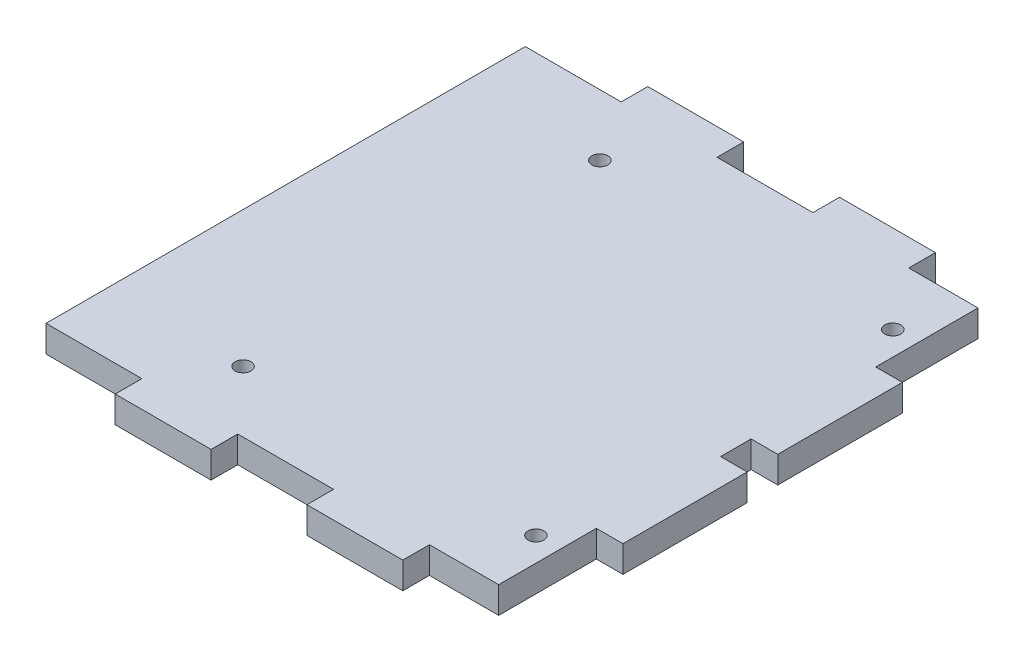
ISO-10303-21;
HEADER;
FILE_DESCRIPTION(('STEP AP214'),'2;1');
FILE_NAME('part.step','',(''),(''),'','','');
FILE_SCHEMA(('AUTOMOTIVE_DESIGN { 1 0 10303 214 1 1 1 1 }'));
ENDSEC;
DATA;
#1=APPLICATION_CONTEXT('core data for automotive mechanical design processes');
#2=APPLICATION_PROTOCOL_DEFINITION('international standard','automotive_design',2000,#1);
#3=PRODUCT_CONTEXT('',#1,'mechanical');
#4=PRODUCT('Part','Part','',(#3));
#5=PRODUCT_RELATED_PRODUCT_CATEGORY('part','',(#4));
#6=PRODUCT_DEFINITION_FORMATION('','',#4);
#7=PRODUCT_DEFINITION_CONTEXT('part definition',#1,'design');
#8=PRODUCT_DEFINITION('design','',#6,#7);
#9=PRODUCT_DEFINITION_SHAPE('','',#8);
#10=(LENGTH_UNIT() NAMED_UNIT(*) SI_UNIT(.MILLI.,.METRE.));
#11=(NAMED_UNIT(*) PLANE_ANGLE_UNIT() SI_UNIT($,.RADIAN.));
#12=(NAMED_UNIT(*) SI_UNIT($,.STERADIAN.) SOLID_ANGLE_UNIT());
#13=UNCERTAINTY_MEASURE_WITH_UNIT(LENGTH_MEASURE(1.E-05),#10,'distance_accuracy_value','');
#14=(GEOMETRIC_REPRESENTATION_CONTEXT(3) GLOBAL_UNCERTAINTY_ASSIGNED_CONTEXT((#13)) GLOBAL_UNIT_ASSIGNED_CONTEXT((#10,
#11,#12)) REPRESENTATION_CONTEXT('',''));
#15=CARTESIAN_POINT('',(0.,0.,0.));
#16=DIRECTION('',(0.,0.,1.));
#17=DIRECTION('',(1.,0.,0.));
#18=AXIS2_PLACEMENT_3D('',#15,#16,#17);
#19=CARTESIAN_POINT('',(57.15,6.35,63.5));
#20=DIRECTION('',(-1.,0.,0.));
#21=DIRECTION('',(0.,0.,1.));
#22=AXIS2_PLACEMENT_3D('',#19,#20,#21);
#23=PLANE('',#22);
#24=DIRECTION('',(0.,-1.,0.));
#25=VECTOR('',#24,1.);
#26=CARTESIAN_POINT('',(57.1500000000002,0.,33.8666666666667));
#27=LINE('',#26,#25);
#28=CARTESIAN_POINT('',(57.1500000000002,6.34999999999998,33.8666666666667));
#29=VERTEX_POINT('',#28);
#30=CARTESIAN_POINT('',(57.1500000000002,0.,33.8666666666667));
#31=VERTEX_POINT('',#30);
#32=EDGE_CURVE('E373',#29,#31,#27,.T.);
#33=ORIENTED_EDGE('',*,*,#32,.T.);
#34=DIRECTION('',(0.,0.,-1.));
#35=VECTOR('',#34,1.);
#36=CARTESIAN_POINT('',(57.15,0.,63.5));
#37=LINE('',#36,#35);
#38=CARTESIAN_POINT('',(57.1500000000002,0.,4.2333333333334));
#39=VERTEX_POINT('',#38);
#40=EDGE_CURVE('E276',#31,#39,#37,.T.);
#41=ORIENTED_EDGE('',*,*,#40,.T.);
#42=DIRECTION('',(0.,1.,0.));
#43=VECTOR('',#42,1.);
#44=CARTESIAN_POINT('',(57.1500000000002,0.,4.2333333333334));
#45=LINE('',#44,#43);
#46=CARTESIAN_POINT('',(57.1500000000002,6.34999999999998,4.2333333333334));
#47=VERTEX_POINT('',#46);
#48=EDGE_CURVE('E369',#39,#47,#45,.T.);
#49=ORIENTED_EDGE('',*,*,#48,.T.);
#50=DIRECTION('',(0.,0.,-1.));
#51=VECTOR('',#50,1.);
#52=CARTESIAN_POINT('',(57.15,6.35,63.5));
#53=LINE('',#52,#51);
#54=EDGE_CURVE('E258',#29,#47,#53,.T.);
#55=ORIENTED_EDGE('',*,*,#54,.F.);
#56=EDGE_LOOP('',(#33,#41,#49,#55));
#57=FACE_BOUND('',#56,.T.);
#58=ADVANCED_FACE('F45',(#57),#23,.F.);
#59=CARTESIAN_POINT('',(-57.15,6.35,-63.5));
#60=DIRECTION('',(0.,0.,1.));
#61=DIRECTION('',(1.,0.,0.));
#62=AXIS2_PLACEMENT_3D('',#59,#60,#61);
#63=PLANE('',#62);
#64=DIRECTION('',(0.,-1.,0.));
#65=VECTOR('',#64,1.);
#66=CARTESIAN_POINT('',(-34.29,0.,-63.4999999999997));
#67=LINE('',#66,#65);
#68=CARTESIAN_POINT('',(-34.29,6.35000000000005,-63.4999999999997));
#69=VERTEX_POINT('',#68);
#70=CARTESIAN_POINT('',(-34.29,0.,-63.5));
#71=VERTEX_POINT('',#70);
#72=EDGE_CURVE('E324',#69,#71,#67,.T.);
#73=ORIENTED_EDGE('',*,*,#72,.F.);
#74=DIRECTION('',(-1.,0.,0.));
#75=VECTOR('',#74,1.);
#76=CARTESIAN_POINT('',(-57.15,6.35,-63.5));
#77=LINE('',#76,#75);
#78=CARTESIAN_POINT('',(-11.43,6.35000000000006,-63.4999999999997));
#79=VERTEX_POINT('',#78);
#80=EDGE_CURVE('E286',#79,#69,#77,.T.);
#81=ORIENTED_EDGE('',*,*,#80,.F.);
#82=DIRECTION('',(0.,1.,0.));
#83=VECTOR('',#82,1.);
#84=CARTESIAN_POINT('',(-11.43,0.,-63.4999999999997));
#85=LINE('',#84,#83);
#86=CARTESIAN_POINT('',(-11.43,0.,-63.4999999999997));
#87=VERTEX_POINT('',#86);
#88=EDGE_CURVE('E314',#87,#79,#85,.T.);
#89=ORIENTED_EDGE('',*,*,#88,.F.);
#90=DIRECTION('',(-1.,0.,0.));
#91=VECTOR('',#90,1.);
#92=CARTESIAN_POINT('',(-57.15,0.,-63.5));
#93=LINE('',#92,#91);
#94=EDGE_CURVE('E272',#87,#71,#93,.T.);
#95=ORIENTED_EDGE('',*,*,#94,.T.);
#96=EDGE_LOOP('',(#73,#81,#89,#95));
#97=FACE_BOUND('',#96,.T.);
#98=ADVANCED_FACE('F487',(#97),#63,.F.);
#99=DIRECTION('',(0.,-1.,0.));
#100=VECTOR('',#99,1.);
#101=CARTESIAN_POINT('',(11.43,0.,-63.4999999999997));
#102=LINE('',#101,#100);
#103=CARTESIAN_POINT('',(11.43,6.35000000000005,-63.4999999999997));
#104=VERTEX_POINT('',#103);
#105=CARTESIAN_POINT('',(11.43,0.,-63.5));
#106=VERTEX_POINT('',#105);
#107=EDGE_CURVE('E344',#104,#106,#102,.T.);
#108=ORIENTED_EDGE('',*,*,#107,.F.);
#109=CARTESIAN_POINT('',(34.29,6.35000000000005,-63.4999999999997));
#110=VERTEX_POINT('',#109);
#111=EDGE_CURVE('E285',#110,#104,#77,.T.);
#112=ORIENTED_EDGE('',*,*,#111,.F.);
#113=DIRECTION('',(0.,1.,0.));
#114=VECTOR('',#113,1.);
#115=CARTESIAN_POINT('',(34.29,0.,-63.4999999999997));
#116=LINE('',#115,#114);
#117=CARTESIAN_POINT('',(34.29,0.,-63.4999999999997));
#118=VERTEX_POINT('',#117);
#119=EDGE_CURVE('E334',#118,#110,#116,.T.);
#120=ORIENTED_EDGE('',*,*,#119,.F.);
#121=EDGE_CURVE('E267',#118,#106,#93,.T.);
#122=ORIENTED_EDGE('',*,*,#121,.T.);
#123=EDGE_LOOP('',(#108,#112,#120,#122));
#124=FACE_BOUND('',#123,.T.);
#125=ADVANCED_FACE('F492',(#124),#63,.F.);
#126=CARTESIAN_POINT('',(-57.15,6.35,63.5));
#127=DIRECTION('',(1.,0.,0.));
#128=DIRECTION('',(0.,0.,-1.));
#129=AXIS2_PLACEMENT_3D('',#126,#127,#128);
#130=PLANE('',#129);
#131=DIRECTION('',(0.,-1.,0.));
#132=VECTOR('',#131,1.);
#133=CARTESIAN_POINT('',(-57.15,0.,-57.1499999999997));
#134=LINE('',#133,#132);
#135=CARTESIAN_POINT('',(-57.15,6.35,-57.1499999999997));
#136=VERTEX_POINT('',#135);
#137=CARTESIAN_POINT('',(-57.15,0.,-57.1499999999997));
#138=VERTEX_POINT('',#137);
#139=EDGE_CURVE('E305',#136,#138,#134,.T.);
#140=ORIENTED_EDGE('',*,*,#139,.T.);
#141=DIRECTION('',(0.,0.,1.));
#142=VECTOR('',#141,1.);
#143=CARTESIAN_POINT('',(-57.15,0.,63.5));
#144=LINE('',#143,#142);
#145=CARTESIAN_POINT('',(-57.15,0.,57.1500000000002));
#146=VERTEX_POINT('',#145);
#147=EDGE_CURVE('E261',#138,#146,#144,.T.);
#148=ORIENTED_EDGE('',*,*,#147,.T.);
#149=DIRECTION('',(0.,1.,0.));
#150=VECTOR('',#149,1.);
#151=CARTESIAN_POINT('',(-57.15,0.,57.1500000000002));
#152=LINE('',#151,#150);
#153=CARTESIAN_POINT('',(-57.15,6.35,57.1500000000002));
#154=VERTEX_POINT('',#153);
#155=EDGE_CURVE('E400',#146,#154,#152,.T.);
#156=ORIENTED_EDGE('',*,*,#155,.T.);
#157=DIRECTION('',(0.,0.,1.));
#158=VECTOR('',#157,1.);
#159=CARTESIAN_POINT('',(-57.15,6.35,63.5));
#160=LINE('',#159,#158);
#161=EDGE_CURVE('E282',#136,#154,#160,.T.);
#162=ORIENTED_EDGE('',*,*,#161,.F.);
#163=EDGE_LOOP('',(#140,#148,#156,#162));
#164=FACE_BOUND('',#163,.T.);
#165=ADVANCED_FACE('F559',(#164),#130,.F.);
#166=CARTESIAN_POINT('',(-57.15,6.35,63.5));
#167=DIRECTION('',(0.,0.,-1.));
#168=DIRECTION('',(-1.,0.,0.));
#169=AXIS2_PLACEMENT_3D('',#166,#167,#168);
#170=PLANE('',#169);
#171=DIRECTION('',(0.,-1.,0.));
#172=VECTOR('',#171,1.);
#173=CARTESIAN_POINT('',(34.29,0.,63.5000000000002));
#174=LINE('',#173,#172);
#175=CARTESIAN_POINT('',(34.29,6.35000000000005,63.5000000000002));
#176=VERTEX_POINT('',#175);
#177=CARTESIAN_POINT('',(34.29,0.,63.5));
#178=VERTEX_POINT('',#177);
#179=EDGE_CURVE('E417',#176,#178,#174,.T.);
#180=ORIENTED_EDGE('',*,*,#179,.F.);
#181=DIRECTION('',(1.,0.,0.));
#182=VECTOR('',#181,1.);
#183=CARTESIAN_POINT('',(-57.15,6.35,63.5));
#184=LINE('',#183,#182);
#185=CARTESIAN_POINT('',(11.43,6.35000000000006,63.5000000000002));
#186=VERTEX_POINT('',#185);
#187=EDGE_CURVE('E54',#186,#176,#184,.T.);
#188=ORIENTED_EDGE('',*,*,#187,.F.);
#189=DIRECTION('',(0.,1.,0.));
#190=VECTOR('',#189,1.);
#191=CARTESIAN_POINT('',(11.43,0.,63.5000000000002));
#192=LINE('',#191,#190);
#193=CARTESIAN_POINT('',(11.43,0.,63.5000000000002));
#194=VERTEX_POINT('',#193);
#195=EDGE_CURVE('E407',#194,#186,#192,.T.);
#196=ORIENTED_EDGE('',*,*,#195,.F.);
#197=DIRECTION('',(1.,0.,0.));
#198=VECTOR('',#197,1.);
#199=CARTESIAN_POINT('',(-57.15,0.,63.5));
#200=LINE('',#199,#198);
#201=EDGE_CURVE('E49',#194,#178,#200,.T.);
#202=ORIENTED_EDGE('',*,*,#201,.T.);
#203=EDGE_LOOP('',(#180,#188,#196,#202));
#204=FACE_BOUND('',#203,.T.);
#205=ADVANCED_FACE('F548',(#204),#170,.F.);
#206=DIRECTION('',(0.,-1.,0.));
#207=VECTOR('',#206,1.);
#208=CARTESIAN_POINT('',(-11.43,0.,63.5000000000002));
#209=LINE('',#208,#207);
#210=CARTESIAN_POINT('',(-11.43,6.35000000000005,63.5000000000002));
#211=VERTEX_POINT('',#210);
#212=CARTESIAN_POINT('',(-11.43,0.,63.5));
#213=VERTEX_POINT('',#212);
#214=EDGE_CURVE('E249',#211,#213,#209,.T.);
#215=ORIENTED_EDGE('',*,*,#214,.F.);
#216=CARTESIAN_POINT('',(-34.29,6.35000000000005,63.5000000000002));
#217=VERTEX_POINT('',#216);
#218=EDGE_CURVE('E13',#217,#211,#184,.T.);
#219=ORIENTED_EDGE('',*,*,#218,.F.);
#220=DIRECTION('',(0.,1.,0.));
#221=VECTOR('',#220,1.);
#222=CARTESIAN_POINT('',(-34.29,0.,63.5000000000002));
#223=LINE('',#222,#221);
#224=CARTESIAN_POINT('',(-34.29,0.,63.5000000000002));
#225=VERTEX_POINT('',#224);
#226=EDGE_CURVE('E235',#225,#217,#223,.T.);
#227=ORIENTED_EDGE('',*,*,#226,.F.);
#228=EDGE_CURVE('E248',#225,#213,#200,.T.);
#229=ORIENTED_EDGE('',*,*,#228,.T.);
#230=EDGE_LOOP('',(#215,#219,#227,#229));
#231=FACE_BOUND('',#230,.T.);
#232=ADVANCED_FACE('F247',(#231),#170,.F.);
#233=CARTESIAN_POINT('',(57.15,6.35,-63.5));
#234=DIRECTION('',(0.,-1.,0.));
#235=DIRECTION('',(0.,0.,-1.));
#236=AXIS2_PLACEMENT_3D('',#233,#234,#235);
#237=PLANE('',#236);
#238=CARTESIAN_POINT('',(-24.765,6.35000000000006,-42.5449999999997));
#239=DIRECTION('',(0.,-1.,0.));
#240=DIRECTION('',(0.,0.,-1.));
#241=AXIS2_PLACEMENT_3D('',#238,#239,#240);
#242=CIRCLE('',#241,1.90499999999986);
#243=CARTESIAN_POINT('',(-24.765,6.35000000000006,-44.4499999999996));
#244=VERTEX_POINT('',#243);
#245=EDGE_CURVE('E450',#244,#244,#242,.T.);
#246=ORIENTED_EDGE('',*,*,#245,.T.);
#247=EDGE_LOOP('',(#246));
#248=FACE_BOUND('',#247,.T.);
#249=CARTESIAN_POINT('',(-24.7650000000001,6.35000000000006,42.5450000000001));
#250=DIRECTION('',(0.,-1.,0.));
#251=DIRECTION('',(0.,0.,-1.));
#252=AXIS2_PLACEMENT_3D('',#249,#250,#251);
#253=CIRCLE('',#252,1.90499999999995);
#254=CARTESIAN_POINT('',(-24.7650000000001,6.35000000000006,40.6400000000001));
#255=VERTEX_POINT('',#254);
#256=EDGE_CURVE('E444',#255,#255,#253,.T.);
#257=ORIENTED_EDGE('',*,*,#256,.T.);
#258=EDGE_LOOP('',(#257));
#259=FACE_BOUND('',#258,.T.);
#260=CARTESIAN_POINT('',(45.0850000000001,6.35000000000006,42.5450000000001));
#261=DIRECTION('',(0.,-1.,0.));
#262=DIRECTION('',(0.,0.,-1.));
#263=AXIS2_PLACEMENT_3D('',#260,#261,#262);
#264=CIRCLE('',#263,1.90499999999995);
#265=CARTESIAN_POINT('',(45.0850000000001,6.35000000000006,40.6400000000001));
#266=VERTEX_POINT('',#265);
#267=EDGE_CURVE('E438',#266,#266,#264,.T.);
#268=ORIENTED_EDGE('',*,*,#267,.T.);
#269=EDGE_LOOP('',(#268));
#270=FACE_BOUND('',#269,.T.);
#271=CARTESIAN_POINT('',(45.0850000000001,6.35000000000006,-42.5449999999997));
#272=DIRECTION('',(0.,-1.,0.));
#273=DIRECTION('',(0.,0.,-1.));
#274=AXIS2_PLACEMENT_3D('',#271,#272,#273);
#275=CIRCLE('',#274,1.90499999999987);
#276=CARTESIAN_POINT('',(45.0850000000001,6.35000000000006,-44.4499999999996));
#277=VERTEX_POINT('',#276);
#278=EDGE_CURVE('E429',#277,#277,#275,.T.);
#279=ORIENTED_EDGE('',*,*,#278,.T.);
#280=EDGE_LOOP('',(#279));
#281=FACE_BOUND('',#280,.T.);
#282=DIRECTION('',(0.,0.,-1.));
#283=VECTOR('',#282,1.);
#284=CARTESIAN_POINT('',(-11.43,6.35000000000005,63.5000000000002));
#285=LINE('',#284,#283);
#286=CARTESIAN_POINT('',(-11.43,6.35000000000005,57.1500000000002));
#287=VERTEX_POINT('',#286);
#288=EDGE_CURVE('E420',#211,#287,#285,.T.);
#289=ORIENTED_EDGE('',*,*,#288,.T.);
#290=DIRECTION('',(-1.,0.,0.));
#291=VECTOR('',#290,1.);
#292=CARTESIAN_POINT('',(57.15,6.35,57.1500000000003));
#293=LINE('',#292,#291);
#294=CARTESIAN_POINT('',(11.43,6.35000000000005,57.1500000000002));
#295=VERTEX_POINT('',#294);
#296=EDGE_CURVE('E299',#295,#287,#293,.T.);
#297=ORIENTED_EDGE('',*,*,#296,.F.);
#298=DIRECTION('',(0.,0.,-1.));
#299=VECTOR('',#298,1.);
#300=CARTESIAN_POINT('',(11.43,6.35000000000005,63.5000000000002));
#301=LINE('',#300,#299);
#302=EDGE_CURVE('E410',#186,#295,#301,.T.);
#303=ORIENTED_EDGE('',*,*,#302,.F.);
#304=ORIENTED_EDGE('',*,*,#187,.T.);
#305=DIRECTION('',(0.,0.,-1.));
#306=VECTOR('',#305,1.);
#307=CARTESIAN_POINT('',(34.29,6.35000000000005,63.5000000000002));
#308=LINE('',#307,#306);
#309=CARTESIAN_POINT('',(34.29,6.35000000000005,57.1500000000002));
#310=VERTEX_POINT('',#309);
#311=EDGE_CURVE('E402',#176,#310,#308,.T.);
#312=ORIENTED_EDGE('',*,*,#311,.T.);
#313=CARTESIAN_POINT('',(50.8000000000002,6.34999999999999,57.15));
#314=VERTEX_POINT('',#313);
#315=EDGE_CURVE('E296',#314,#310,#293,.T.);
#316=ORIENTED_EDGE('',*,*,#315,.F.);
#317=DIRECTION('',(0.,0.,1.));
#318=VECTOR('',#317,1.);
#319=CARTESIAN_POINT('',(50.8000000000002,6.35,-63.5));
#320=LINE('',#319,#318);
#321=CARTESIAN_POINT('',(50.8000000000002,6.34999999999998,33.8666666666667));
#322=VERTEX_POINT('',#321);
#323=EDGE_CURVE('E293',#322,#314,#320,.T.);
#324=ORIENTED_EDGE('',*,*,#323,.F.);
#325=DIRECTION('',(1.,0.,0.));
#326=VECTOR('',#325,1.);
#327=CARTESIAN_POINT('',(50.8000000000002,6.34999999999998,33.8666666666667));
#328=LINE('',#327,#326);
#329=EDGE_CURVE('E366',#322,#29,#328,.T.);
#330=ORIENTED_EDGE('',*,*,#329,.T.);
#331=ORIENTED_EDGE('',*,*,#54,.T.);
#332=DIRECTION('',(1.,0.,0.));
#333=VECTOR('',#332,1.);
#334=CARTESIAN_POINT('',(50.8000000000002,6.34999999999998,4.2333333333334));
#335=LINE('',#334,#333);
#336=CARTESIAN_POINT('',(50.8000000000002,6.34999999999998,4.2333333333334));
#337=VERTEX_POINT('',#336);
#338=EDGE_CURVE('E364',#337,#47,#335,.T.);
#339=ORIENTED_EDGE('',*,*,#338,.F.);
#340=CARTESIAN_POINT('',(50.8000000000002,6.34999999999999,-3.04800000000004));
#341=VERTEX_POINT('',#340);
#342=EDGE_CURVE('E295',#341,#337,#320,.T.);
#343=ORIENTED_EDGE('',*,*,#342,.F.);
#344=DIRECTION('',(-1.,0.,0.));
#345=VECTOR('',#344,1.);
#346=CARTESIAN_POINT('',(310.160847408269,6.34999999999999,-3.04800000000006));
#347=LINE('',#346,#345);
#348=CARTESIAN_POINT('',(57.1500000000002,6.34999999999999,-3.04800000000004));
#349=VERTEX_POINT('',#348);
#350=EDGE_CURVE('E391',#349,#341,#347,.T.);
#351=ORIENTED_EDGE('',*,*,#350,.F.);
#352=CARTESIAN_POINT('',(57.1500000000002,6.35000000000001,-32.7660000000001));
#353=VERTEX_POINT('',#352);
#354=EDGE_CURVE('E256',#349,#353,#53,.T.);
#355=ORIENTED_EDGE('',*,*,#354,.T.);
#356=DIRECTION('',(-1.,0.,0.));
#357=VECTOR('',#356,1.);
#358=CARTESIAN_POINT('',(310.160847408269,6.34999999999999,-32.7660000000001));
#359=LINE('',#358,#357);
#360=CARTESIAN_POINT('',(50.8000000000002,6.35000000000001,-32.766));
#361=VERTEX_POINT('',#360);
#362=EDGE_CURVE('E387',#353,#361,#359,.T.);
#363=ORIENTED_EDGE('',*,*,#362,.T.);
#364=CARTESIAN_POINT('',(50.8,6.35,-57.1499999999997));
#365=VERTEX_POINT('',#364);
#366=EDGE_CURVE('E292',#365,#361,#320,.T.);
#367=ORIENTED_EDGE('',*,*,#366,.F.);
#368=DIRECTION('',(1.,0.,0.));
#369=VECTOR('',#368,1.);
#370=CARTESIAN_POINT('',(57.15,6.35,-57.1499999999997));
#371=LINE('',#370,#369);
#372=CARTESIAN_POINT('',(34.29,6.35000000000005,-57.1499999999997));
#373=VERTEX_POINT('',#372);
#374=EDGE_CURVE('E289',#373,#365,#371,.T.);
#375=ORIENTED_EDGE('',*,*,#374,.F.);
#376=DIRECTION('',(0.,0.,1.));
#377=VECTOR('',#376,1.);
#378=CARTESIAN_POINT('',(34.29,6.35000000000005,-63.4999999999997));
#379=LINE('',#378,#377);
#380=EDGE_CURVE('E337',#110,#373,#379,.T.);
#381=ORIENTED_EDGE('',*,*,#380,.F.);
#382=ORIENTED_EDGE('',*,*,#111,.T.);
#383=DIRECTION('',(0.,0.,1.));
#384=VECTOR('',#383,1.);
#385=CARTESIAN_POINT('',(11.43,6.35000000000005,-63.4999999999997));
#386=LINE('',#385,#384);
#387=CARTESIAN_POINT('',(11.43,6.35000000000005,-57.1499999999997));
#388=VERTEX_POINT('',#387);
#389=EDGE_CURVE('E327',#104,#388,#386,.T.);
#390=ORIENTED_EDGE('',*,*,#389,.T.);
#391=CARTESIAN_POINT('',(-11.43,6.35000000000005,-57.1499999999997));
#392=VERTEX_POINT('',#391);
#393=EDGE_CURVE('E291',#392,#388,#371,.T.);
#394=ORIENTED_EDGE('',*,*,#393,.F.);
#395=DIRECTION('',(0.,0.,1.));
#396=VECTOR('',#395,1.);
#397=CARTESIAN_POINT('',(-11.43,6.35000000000005,-63.4999999999997));
#398=LINE('',#397,#396);
#399=EDGE_CURVE('E317',#79,#392,#398,.T.);
#400=ORIENTED_EDGE('',*,*,#399,.F.);
#401=ORIENTED_EDGE('',*,*,#80,.T.);
#402=DIRECTION('',(0.,0.,1.));
#403=VECTOR('',#402,1.);
#404=CARTESIAN_POINT('',(-34.29,6.35000000000005,-63.4999999999997));
#405=LINE('',#404,#403);
#406=CARTESIAN_POINT('',(-34.29,6.35000000000005,-57.1499999999997));
#407=VERTEX_POINT('',#406);
#408=EDGE_CURVE('E309',#69,#407,#405,.T.);
#409=ORIENTED_EDGE('',*,*,#408,.T.);
#410=EDGE_CURVE('E279',#136,#407,#371,.T.);
#411=ORIENTED_EDGE('',*,*,#410,.F.);
#412=ORIENTED_EDGE('',*,*,#161,.T.);
#413=CARTESIAN_POINT('',(-34.29,6.35000000000005,57.1500000000002));
#414=VERTEX_POINT('',#413);
#415=EDGE_CURVE('E297',#414,#154,#293,.T.);
#416=ORIENTED_EDGE('',*,*,#415,.F.);
#417=DIRECTION('',(0.,0.,-1.));
#418=VECTOR('',#417,1.);
#419=CARTESIAN_POINT('',(-34.29,6.35000000000005,63.5000000000002));
#420=LINE('',#419,#418);
#421=EDGE_CURVE('E240',#217,#414,#420,.T.);
#422=ORIENTED_EDGE('',*,*,#421,.F.);
#423=ORIENTED_EDGE('',*,*,#218,.T.);
#424=EDGE_LOOP('',(#289,#297,#303,#304,#312,#316,#324,#330,#331,#339,#343,#351,#355,#363,#367,
#375,#381,#382,#390,#394,#400,#401,#409,#411,#412,#416,#422,#423));
#425=FACE_BOUND('',#424,.T.);
#426=ADVANCED_FACE('F460',(#248,#259,#270,#281,#425),#237,.F.);
#427=CARTESIAN_POINT('',(57.15,0.,-63.5));
#428=DIRECTION('',(0.,-1.,0.));
#429=DIRECTION('',(0.,0.,-1.));
#430=AXIS2_PLACEMENT_3D('',#427,#428,#429);
#431=PLANE('',#430);
#432=CARTESIAN_POINT('',(-24.765,0.,-42.5449999999997));
#433=DIRECTION('',(0.,-1.,0.));
#434=DIRECTION('',(0.,0.,-1.));
#435=AXIS2_PLACEMENT_3D('',#432,#433,#434);
#436=CIRCLE('',#435,1.90499999999986);
#437=CARTESIAN_POINT('',(-24.765,0.,-44.4499999999996));
#438=VERTEX_POINT('',#437);
#439=EDGE_CURVE('E447',#438,#438,#436,.T.);
#440=ORIENTED_EDGE('',*,*,#439,.F.);
#441=EDGE_LOOP('',(#440));
#442=FACE_BOUND('',#441,.T.);
#443=CARTESIAN_POINT('',(-24.7650000000001,0.,42.5450000000001));
#444=DIRECTION('',(0.,-1.,0.));
#445=DIRECTION('',(0.,0.,-1.));
#446=AXIS2_PLACEMENT_3D('',#443,#444,#445);
#447=CIRCLE('',#446,1.90499999999995);
#448=CARTESIAN_POINT('',(-24.7650000000001,0.,40.6400000000001));
#449=VERTEX_POINT('',#448);
#450=EDGE_CURVE('E441',#449,#449,#447,.T.);
#451=ORIENTED_EDGE('',*,*,#450,.F.);
#452=EDGE_LOOP('',(#451));
#453=FACE_BOUND('',#452,.T.);
#454=CARTESIAN_POINT('',(45.0850000000001,0.,42.5450000000001));
#455=DIRECTION('',(0.,-1.,0.));
#456=DIRECTION('',(0.,0.,-1.));
#457=AXIS2_PLACEMENT_3D('',#454,#455,#456);
#458=CIRCLE('',#457,1.90499999999995);
#459=CARTESIAN_POINT('',(45.0850000000001,0.,40.6400000000001));
#460=VERTEX_POINT('',#459);
#461=EDGE_CURVE('E435',#460,#460,#458,.T.);
#462=ORIENTED_EDGE('',*,*,#461,.F.);
#463=EDGE_LOOP('',(#462));
#464=FACE_BOUND('',#463,.T.);
#465=CARTESIAN_POINT('',(45.0850000000001,0.,-42.5449999999997));
#466=DIRECTION('',(0.,-1.,0.));
#467=DIRECTION('',(0.,0.,-1.));
#468=AXIS2_PLACEMENT_3D('',#465,#466,#467);
#469=CIRCLE('',#468,1.90499999999987);
#470=CARTESIAN_POINT('',(45.0850000000001,0.,-44.4499999999996));
#471=VERTEX_POINT('',#470);
#472=EDGE_CURVE('E432',#471,#471,#469,.T.);
#473=ORIENTED_EDGE('',*,*,#472,.F.);
#474=EDGE_LOOP('',(#473));
#475=FACE_BOUND('',#474,.T.);
#476=ORIENTED_EDGE('',*,*,#147,.F.);
#477=DIRECTION('',(1.,0.,0.));
#478=VECTOR('',#477,1.);
#479=CARTESIAN_POINT('',(-57.15,0.,-57.1499999999997));
#480=LINE('',#479,#478);
#481=CARTESIAN_POINT('',(-34.29,0.,-57.1499999999997));
#482=VERTEX_POINT('',#481);
#483=EDGE_CURVE('E300',#138,#482,#480,.T.);
#484=ORIENTED_EDGE('',*,*,#483,.T.);
#485=DIRECTION('',(0.,0.,1.));
#486=VECTOR('',#485,1.);
#487=CARTESIAN_POINT('',(-34.29,0.,-63.4999999999997));
#488=LINE('',#487,#486);
#489=EDGE_CURVE('E310',#71,#482,#488,.T.);
#490=ORIENTED_EDGE('',*,*,#489,.F.);
#491=ORIENTED_EDGE('',*,*,#94,.F.);
#492=DIRECTION('',(0.,0.,1.));
#493=VECTOR('',#492,1.);
#494=CARTESIAN_POINT('',(-11.43,0.,-63.4999999999997));
#495=LINE('',#494,#493);
#496=CARTESIAN_POINT('',(-11.43,0.,-57.1499999999997));
#497=VERTEX_POINT('',#496);
#498=EDGE_CURVE('E313',#87,#497,#495,.T.);
#499=ORIENTED_EDGE('',*,*,#498,.T.);
#500=CARTESIAN_POINT('',(11.43,0.,-57.1499999999997));
#501=VERTEX_POINT('',#500);
#502=EDGE_CURVE('E303',#497,#501,#480,.T.);
#503=ORIENTED_EDGE('',*,*,#502,.T.);
#504=DIRECTION('',(0.,0.,1.));
#505=VECTOR('',#504,1.);
#506=CARTESIAN_POINT('',(11.43,0.,-63.4999999999997));
#507=LINE('',#506,#505);
#508=EDGE_CURVE('E330',#106,#501,#507,.T.);
#509=ORIENTED_EDGE('',*,*,#508,.F.);
#510=ORIENTED_EDGE('',*,*,#121,.F.);
#511=DIRECTION('',(0.,0.,1.));
#512=VECTOR('',#511,1.);
#513=CARTESIAN_POINT('',(34.29,0.,-63.4999999999997));
#514=LINE('',#513,#512);
#515=CARTESIAN_POINT('',(34.29,0.,-57.1499999999997));
#516=VERTEX_POINT('',#515);
#517=EDGE_CURVE('E333',#118,#516,#514,.T.);
#518=ORIENTED_EDGE('',*,*,#517,.T.);
#519=CARTESIAN_POINT('',(50.7999999999999,0.,-57.1499999999997));
#520=VERTEX_POINT('',#519);
#521=EDGE_CURVE('E304',#516,#520,#480,.T.);
#522=ORIENTED_EDGE('',*,*,#521,.T.);
#523=DIRECTION('',(0.,0.,1.));
#524=VECTOR('',#523,1.);
#525=CARTESIAN_POINT('',(50.8000000000002,0.,-25.3999999999999));
#526=LINE('',#525,#524);
#527=CARTESIAN_POINT('',(50.8000000000002,0.,-32.7660000000001));
#528=VERTEX_POINT('',#527);
#529=EDGE_CURVE('E354',#520,#528,#526,.T.);
#530=ORIENTED_EDGE('',*,*,#529,.T.);
#531=DIRECTION('',(-1.,0.,0.));
#532=VECTOR('',#531,1.);
#533=CARTESIAN_POINT('',(310.160847408269,0.,-32.7660000000001));
#534=LINE('',#533,#532);
#535=CARTESIAN_POINT('',(57.15,0.,-32.7660000000001));
#536=VERTEX_POINT('',#535);
#537=EDGE_CURVE('E385',#536,#528,#534,.T.);
#538=ORIENTED_EDGE('',*,*,#537,.F.);
#539=CARTESIAN_POINT('',(57.1500000000002,0.,-3.04800000000004));
#540=VERTEX_POINT('',#539);
#541=EDGE_CURVE('E277',#540,#536,#37,.T.);
#542=ORIENTED_EDGE('',*,*,#541,.F.);
#543=DIRECTION('',(-1.,0.,0.));
#544=VECTOR('',#543,1.);
#545=CARTESIAN_POINT('',(310.160847408269,0.,-3.04800000000007));
#546=LINE('',#545,#544);
#547=CARTESIAN_POINT('',(50.8000000000002,0.,-3.04800000000007));
#548=VERTEX_POINT('',#547);
#549=EDGE_CURVE('E390',#540,#548,#546,.T.);
#550=ORIENTED_EDGE('',*,*,#549,.T.);
#551=CARTESIAN_POINT('',(50.8000000000002,0.,4.2333333333334));
#552=VERTEX_POINT('',#551);
#553=EDGE_CURVE('E62',#548,#552,#526,.T.);
#554=ORIENTED_EDGE('',*,*,#553,.T.);
#555=DIRECTION('',(1.,0.,0.));
#556=VECTOR('',#555,1.);
#557=CARTESIAN_POINT('',(50.8000000000002,0.,4.2333333333334));
#558=LINE('',#557,#556);
#559=EDGE_CURVE('E360',#552,#39,#558,.T.);
#560=ORIENTED_EDGE('',*,*,#559,.T.);
#561=ORIENTED_EDGE('',*,*,#40,.F.);
#562=DIRECTION('',(1.,0.,0.));
#563=VECTOR('',#562,1.);
#564=CARTESIAN_POINT('',(50.8000000000002,0.,33.8666666666667));
#565=LINE('',#564,#563);
#566=CARTESIAN_POINT('',(50.8000000000002,0.,33.8666666666667));
#567=VERTEX_POINT('',#566);
#568=EDGE_CURVE('E358',#567,#31,#565,.T.);
#569=ORIENTED_EDGE('',*,*,#568,.F.);
#570=CARTESIAN_POINT('',(50.8000000000002,-1.94289029309402E-13,57.1500000000001));
#571=VERTEX_POINT('',#570);
#572=EDGE_CURVE('E357',#567,#571,#526,.T.);
#573=ORIENTED_EDGE('',*,*,#572,.T.);
#574=DIRECTION('',(-1.,0.,0.));
#575=VECTOR('',#574,1.);
#576=CARTESIAN_POINT('',(57.15,0.,57.1500000000002));
#577=LINE('',#576,#575);
#578=CARTESIAN_POINT('',(34.29,0.,57.1500000000002));
#579=VERTEX_POINT('',#578);
#580=EDGE_CURVE('E394',#571,#579,#577,.T.);
#581=ORIENTED_EDGE('',*,*,#580,.T.);
#582=DIRECTION('',(0.,0.,-1.));
#583=VECTOR('',#582,1.);
#584=CARTESIAN_POINT('',(34.29,0.,63.5000000000002));
#585=LINE('',#584,#583);
#586=EDGE_CURVE('E403',#178,#579,#585,.T.);
#587=ORIENTED_EDGE('',*,*,#586,.F.);
#588=ORIENTED_EDGE('',*,*,#201,.F.);
#589=DIRECTION('',(0.,0.,-1.));
#590=VECTOR('',#589,1.);
#591=CARTESIAN_POINT('',(11.43,0.,63.5000000000002));
#592=LINE('',#591,#590);
#593=CARTESIAN_POINT('',(11.43,0.,57.1500000000002));
#594=VERTEX_POINT('',#593);
#595=EDGE_CURVE('E406',#194,#594,#592,.T.);
#596=ORIENTED_EDGE('',*,*,#595,.T.);
#597=CARTESIAN_POINT('',(-11.43,0.,57.1500000000002));
#598=VERTEX_POINT('',#597);
#599=EDGE_CURVE('E399',#594,#598,#577,.T.);
#600=ORIENTED_EDGE('',*,*,#599,.T.);
#601=DIRECTION('',(0.,0.,-1.));
#602=VECTOR('',#601,1.);
#603=CARTESIAN_POINT('',(-11.43,0.,63.5000000000002));
#604=LINE('',#603,#602);
#605=EDGE_CURVE('E241',#213,#598,#604,.T.);
#606=ORIENTED_EDGE('',*,*,#605,.F.);
#607=ORIENTED_EDGE('',*,*,#228,.F.);
#608=DIRECTION('',(0.,0.,-1.));
#609=VECTOR('',#608,1.);
#610=CARTESIAN_POINT('',(-34.29,0.,63.5000000000002));
#611=LINE('',#610,#609);
#612=CARTESIAN_POINT('',(-34.29,0.,57.1500000000002));
#613=VERTEX_POINT('',#612);
#614=EDGE_CURVE('E232',#225,#613,#611,.T.);
#615=ORIENTED_EDGE('',*,*,#614,.T.);
#616=EDGE_CURVE('E70',#613,#146,#577,.T.);
#617=ORIENTED_EDGE('',*,*,#616,.T.);
#618=EDGE_LOOP('',(#476,#484,#490,#491,#499,#503,#509,#510,#518,#522,#530,#538,#542,#550,#554,
#560,#561,#569,#573,#581,#587,#588,#596,#600,#606,#607,#615,#617));
#619=FACE_BOUND('',#618,.T.);
#620=ADVANCED_FACE('F253',(#442,#453,#464,#475,#619),#431,.T.);
#621=ORIENTED_EDGE('',*,*,#541,.T.);
#622=DIRECTION('',(0.,-1.,0.));
#623=VECTOR('',#622,1.);
#624=CARTESIAN_POINT('',(57.1500000000002,203.2,-32.7660000000003));
#625=LINE('',#624,#623);
#626=EDGE_CURVE('E381',#353,#536,#625,.T.);
#627=ORIENTED_EDGE('',*,*,#626,.F.);
#628=ORIENTED_EDGE('',*,*,#354,.F.);
#629=DIRECTION('',(0.,1.,0.));
#630=VECTOR('',#629,1.);
#631=CARTESIAN_POINT('',(57.1500000000002,203.2,-3.04799999999994));
#632=LINE('',#631,#630);
#633=EDGE_CURVE('E383',#540,#349,#632,.T.);
#634=ORIENTED_EDGE('',*,*,#633,.F.);
#635=EDGE_LOOP('',(#621,#627,#628,#634));
#636=FACE_BOUND('',#635,.T.);
#637=ADVANCED_FACE('F47',(#636),#23,.F.);
#638=CARTESIAN_POINT('',(-34.29,0.,63.5000000000002));
#639=DIRECTION('',(-1.,0.,0.));
#640=DIRECTION('',(0.,0.,1.));
#641=AXIS2_PLACEMENT_3D('',#638,#639,#640);
#642=PLANE('',#641);
#643=DIRECTION('',(0.,1.,0.));
#644=VECTOR('',#643,1.);
#645=CARTESIAN_POINT('',(-34.29,0.,57.1500000000002));
#646=LINE('',#645,#644);
#647=EDGE_CURVE('E237',#613,#414,#646,.T.);
#648=ORIENTED_EDGE('',*,*,#647,.F.);
#649=ORIENTED_EDGE('',*,*,#614,.F.);
#650=ORIENTED_EDGE('',*,*,#226,.T.);
#651=ORIENTED_EDGE('',*,*,#421,.T.);
#652=EDGE_LOOP('',(#648,#649,#650,#651));
#653=FACE_BOUND('',#652,.T.);
#654=ADVANCED_FACE('F234',(#653),#642,.T.);
#655=CARTESIAN_POINT('',(-57.15,203.2,57.1500000000002));
#656=DIRECTION('',(0.,0.,1.));
#657=DIRECTION('',(1.,0.,0.));
#658=AXIS2_PLACEMENT_3D('',#655,#656,#657);
#659=PLANE('',#658);
#660=ORIENTED_EDGE('',*,*,#415,.T.);
#661=ORIENTED_EDGE('',*,*,#155,.F.);
#662=ORIENTED_EDGE('',*,*,#616,.F.);
#663=ORIENTED_EDGE('',*,*,#647,.T.);
#664=EDGE_LOOP('',(#660,#661,#662,#663));
#665=FACE_BOUND('',#664,.T.);
#666=ADVANCED_FACE('F499',(#665),#659,.T.);
#667=CARTESIAN_POINT('',(-11.43,0.,63.5000000000002));
#668=DIRECTION('',(1.,0.,0.));
#669=DIRECTION('',(0.,-1.,0.));
#670=AXIS2_PLACEMENT_3D('',#667,#668,#669);
#671=PLANE('',#670);
#672=DIRECTION('',(0.,-1.,0.));
#673=VECTOR('',#672,1.);
#674=CARTESIAN_POINT('',(-11.43,0.,57.1500000000002));
#675=LINE('',#674,#673);
#676=EDGE_CURVE('E428',#287,#598,#675,.T.);
#677=ORIENTED_EDGE('',*,*,#676,.F.);
#678=ORIENTED_EDGE('',*,*,#288,.F.);
#679=ORIENTED_EDGE('',*,*,#214,.T.);
#680=ORIENTED_EDGE('',*,*,#605,.T.);
#681=EDGE_LOOP('',(#677,#678,#679,#680));
#682=FACE_BOUND('',#681,.T.);
#683=ADVANCED_FACE('F634',(#682),#671,.T.);
#684=CARTESIAN_POINT('',(11.43,0.,63.5000000000002));
#685=DIRECTION('',(-1.,0.,0.));
#686=DIRECTION('',(0.,1.,0.));
#687=AXIS2_PLACEMENT_3D('',#684,#685,#686);
#688=PLANE('',#687);
#689=DIRECTION('',(0.,1.,0.));
#690=VECTOR('',#689,1.);
#691=CARTESIAN_POINT('',(11.43,0.,57.1500000000002));
#692=LINE('',#691,#690);
#693=EDGE_CURVE('E414',#594,#295,#692,.T.);
#694=ORIENTED_EDGE('',*,*,#693,.F.);
#695=ORIENTED_EDGE('',*,*,#595,.F.);
#696=ORIENTED_EDGE('',*,*,#195,.T.);
#697=ORIENTED_EDGE('',*,*,#302,.T.);
#698=EDGE_LOOP('',(#694,#695,#696,#697));
#699=FACE_BOUND('',#698,.T.);
#700=ADVANCED_FACE('F545',(#699),#688,.T.);
#701=ORIENTED_EDGE('',*,*,#296,.T.);
#702=ORIENTED_EDGE('',*,*,#676,.T.);
#703=ORIENTED_EDGE('',*,*,#599,.F.);
#704=ORIENTED_EDGE('',*,*,#693,.T.);
#705=EDGE_LOOP('',(#701,#702,#703,#704));
#706=FACE_BOUND('',#705,.T.);
#707=ADVANCED_FACE('F551',(#706),#659,.T.);
#708=CARTESIAN_POINT('',(34.29,0.,63.5000000000002));
#709=DIRECTION('',(1.,0.,0.));
#710=DIRECTION('',(0.,-1.,0.));
#711=AXIS2_PLACEMENT_3D('',#708,#709,#710);
#712=PLANE('',#711);
#713=DIRECTION('',(0.,-1.,0.));
#714=VECTOR('',#713,1.);
#715=CARTESIAN_POINT('',(34.29,0.,57.1500000000002));
#716=LINE('',#715,#714);
#717=EDGE_CURVE('E418',#310,#579,#716,.T.);
#718=ORIENTED_EDGE('',*,*,#717,.F.);
#719=ORIENTED_EDGE('',*,*,#311,.F.);
#720=ORIENTED_EDGE('',*,*,#179,.T.);
#721=ORIENTED_EDGE('',*,*,#586,.T.);
#722=EDGE_LOOP('',(#718,#719,#720,#721));
#723=FACE_BOUND('',#722,.T.);
#724=ADVANCED_FACE('F542',(#723),#712,.T.);
#725=ORIENTED_EDGE('',*,*,#315,.T.);
#726=ORIENTED_EDGE('',*,*,#717,.T.);
#727=ORIENTED_EDGE('',*,*,#580,.F.);
#728=DIRECTION('',(0.,-1.,0.));
#729=VECTOR('',#728,1.);
#730=CARTESIAN_POINT('',(50.8000000000002,203.2,57.15));
#731=LINE('',#730,#729);
#732=EDGE_CURVE('E376',#314,#571,#731,.T.);
#733=ORIENTED_EDGE('',*,*,#732,.F.);
#734=EDGE_LOOP('',(#725,#726,#727,#733));
#735=FACE_BOUND('',#734,.T.);
#736=ADVANCED_FACE('F539',(#735),#659,.T.);
#737=CARTESIAN_POINT('',(50.8000000000002,0.,33.8666666666667));
#738=DIRECTION('',(0.,0.,1.));
#739=DIRECTION('',(1.,0.,0.));
#740=AXIS2_PLACEMENT_3D('',#737,#738,#739);
#741=PLANE('',#740);
#742=ORIENTED_EDGE('',*,*,#32,.F.);
#743=ORIENTED_EDGE('',*,*,#329,.F.);
#744=DIRECTION('',(0.,-1.,0.));
#745=VECTOR('',#744,1.);
#746=CARTESIAN_POINT('',(50.8000000000002,0.,33.8666666666667));
#747=LINE('',#746,#745);
#748=EDGE_CURVE('E372',#322,#567,#747,.T.);
#749=ORIENTED_EDGE('',*,*,#748,.T.);
#750=ORIENTED_EDGE('',*,*,#568,.T.);
#751=EDGE_LOOP('',(#742,#743,#749,#750));
#752=FACE_BOUND('',#751,.T.);
#753=ADVANCED_FACE('F670',(#752),#741,.T.);
#754=CARTESIAN_POINT('',(50.8000000000002,203.2,63.5000000000001));
#755=DIRECTION('',(1.,0.,0.));
#756=DIRECTION('',(0.,0.,-1.));
#757=AXIS2_PLACEMENT_3D('',#754,#755,#756);
#758=PLANE('',#757);
#759=ORIENTED_EDGE('',*,*,#323,.T.);
#760=ORIENTED_EDGE('',*,*,#732,.T.);
#761=ORIENTED_EDGE('',*,*,#572,.F.);
#762=ORIENTED_EDGE('',*,*,#748,.F.);
#763=EDGE_LOOP('',(#759,#760,#761,#762));
#764=FACE_BOUND('',#763,.T.);
#765=ADVANCED_FACE('F535',(#764),#758,.T.);
#766=CARTESIAN_POINT('',(50.8000000000002,0.,4.2333333333334));
#767=DIRECTION('',(0.,0.,-1.));
#768=DIRECTION('',(-1.,0.,0.));
#769=AXIS2_PLACEMENT_3D('',#766,#767,#768);
#770=PLANE('',#769);
#771=ORIENTED_EDGE('',*,*,#48,.F.);
#772=ORIENTED_EDGE('',*,*,#559,.F.);
#773=DIRECTION('',(0.,1.,0.));
#774=VECTOR('',#773,1.);
#775=CARTESIAN_POINT('',(50.8000000000002,0.,4.2333333333334));
#776=LINE('',#775,#774);
#777=EDGE_CURVE('E361',#552,#337,#776,.T.);
#778=ORIENTED_EDGE('',*,*,#777,.T.);
#779=ORIENTED_EDGE('',*,*,#338,.T.);
#780=EDGE_LOOP('',(#771,#772,#778,#779));
#781=FACE_BOUND('',#780,.T.);
#782=ADVANCED_FACE('F522',(#781),#770,.T.);
#783=CARTESIAN_POINT('',(310.160847408269,6.34999999999999,-3.04800000000006));
#784=DIRECTION('',(0.,0.,-1.));
#785=DIRECTION('',(0.,-1.,0.));
#786=AXIS2_PLACEMENT_3D('',#783,#784,#785);
#787=PLANE('',#786);
#788=ORIENTED_EDGE('',*,*,#633,.T.);
#789=ORIENTED_EDGE('',*,*,#350,.T.);
#790=DIRECTION('',(0.,1.,0.));
#791=VECTOR('',#790,1.);
#792=CARTESIAN_POINT('',(50.8000000000002,203.2,-3.04799999999994));
#793=LINE('',#792,#791);
#794=EDGE_CURVE('E352',#548,#341,#793,.T.);
#795=ORIENTED_EDGE('',*,*,#794,.F.);
#796=ORIENTED_EDGE('',*,*,#549,.F.);
#797=EDGE_LOOP('',(#788,#789,#795,#796));
#798=FACE_BOUND('',#797,.T.);
#799=ADVANCED_FACE('F693',(#798),#787,.F.);
#800=ORIENTED_EDGE('',*,*,#342,.T.);
#801=ORIENTED_EDGE('',*,*,#777,.F.);
#802=ORIENTED_EDGE('',*,*,#553,.F.);
#803=ORIENTED_EDGE('',*,*,#794,.T.);
#804=EDGE_LOOP('',(#800,#801,#802,#803));
#805=FACE_BOUND('',#804,.T.);
#806=ADVANCED_FACE('F517',(#805),#758,.T.);
#807=CARTESIAN_POINT('',(310.160847408269,0.,-32.7660000000001));
#808=DIRECTION('',(0.,0.,1.));
#809=DIRECTION('',(0.,1.,0.));
#810=AXIS2_PLACEMENT_3D('',#807,#808,#809);
#811=PLANE('',#810);
#812=ORIENTED_EDGE('',*,*,#626,.T.);
#813=ORIENTED_EDGE('',*,*,#537,.T.);
#814=DIRECTION('',(0.,-1.,0.));
#815=VECTOR('',#814,1.);
#816=CARTESIAN_POINT('',(50.8000000000002,203.2,-32.7660000000003));
#817=LINE('',#816,#815);
#818=EDGE_CURVE('E347',#361,#528,#817,.T.);
#819=ORIENTED_EDGE('',*,*,#818,.F.);
#820=ORIENTED_EDGE('',*,*,#362,.F.);
#821=EDGE_LOOP('',(#812,#813,#819,#820));
#822=FACE_BOUND('',#821,.T.);
#823=ADVANCED_FACE('F509',(#822),#811,.F.);
#824=ORIENTED_EDGE('',*,*,#366,.T.);
#825=ORIENTED_EDGE('',*,*,#818,.T.);
#826=ORIENTED_EDGE('',*,*,#529,.F.);
#827=DIRECTION('',(0.,-1.,0.));
#828=VECTOR('',#827,1.);
#829=CARTESIAN_POINT('',(50.8,29.0285714285715,-57.1499999999997));
#830=LINE('',#829,#828);
#831=EDGE_CURVE('E307',#365,#520,#830,.T.);
#832=ORIENTED_EDGE('',*,*,#831,.F.);
#833=EDGE_LOOP('',(#824,#825,#826,#832));
#834=FACE_BOUND('',#833,.T.);
#835=ADVANCED_FACE('F511',(#834),#758,.T.);
#836=CARTESIAN_POINT('',(34.29,0.,-63.4999999999997));
#837=DIRECTION('',(1.,0.,0.));
#838=DIRECTION('',(0.,0.,-1.));
#839=AXIS2_PLACEMENT_3D('',#836,#837,#838);
#840=PLANE('',#839);
#841=DIRECTION('',(0.,1.,0.));
#842=VECTOR('',#841,1.);
#843=CARTESIAN_POINT('',(34.29,0.,-57.1499999999997));
#844=LINE('',#843,#842);
#845=EDGE_CURVE('E341',#516,#373,#844,.T.);
#846=ORIENTED_EDGE('',*,*,#845,.F.);
#847=ORIENTED_EDGE('',*,*,#517,.F.);
#848=ORIENTED_EDGE('',*,*,#119,.T.);
#849=ORIENTED_EDGE('',*,*,#380,.T.);
#850=EDGE_LOOP('',(#846,#847,#848,#849));
#851=FACE_BOUND('',#850,.T.);
#852=ADVANCED_FACE('F582',(#851),#840,.T.);
#853=CARTESIAN_POINT('',(57.15,203.2,-57.1499999999997));
#854=DIRECTION('',(0.,0.,-1.));
#855=DIRECTION('',(-1.,0.,0.));
#856=AXIS2_PLACEMENT_3D('',#853,#854,#855);
#857=PLANE('',#856);
#858=ORIENTED_EDGE('',*,*,#374,.T.);
#859=ORIENTED_EDGE('',*,*,#831,.T.);
#860=ORIENTED_EDGE('',*,*,#521,.F.);
#861=ORIENTED_EDGE('',*,*,#845,.T.);
#862=EDGE_LOOP('',(#858,#859,#860,#861));
#863=FACE_BOUND('',#862,.T.);
#864=ADVANCED_FACE('F580',(#863),#857,.T.);
#865=CARTESIAN_POINT('',(11.43,0.,-63.4999999999997));
#866=DIRECTION('',(-1.,0.,0.));
#867=DIRECTION('',(0.,-1.,0.));
#868=AXIS2_PLACEMENT_3D('',#865,#866,#867);
#869=PLANE('',#868);
#870=DIRECTION('',(0.,-1.,0.));
#871=VECTOR('',#870,1.);
#872=CARTESIAN_POINT('',(11.43,0.,-57.1499999999997));
#873=LINE('',#872,#871);
#874=EDGE_CURVE('E345',#388,#501,#873,.T.);
#875=ORIENTED_EDGE('',*,*,#874,.F.);
#876=ORIENTED_EDGE('',*,*,#389,.F.);
#877=ORIENTED_EDGE('',*,*,#107,.T.);
#878=ORIENTED_EDGE('',*,*,#508,.T.);
#879=EDGE_LOOP('',(#875,#876,#877,#878));
#880=FACE_BOUND('',#879,.T.);
#881=ADVANCED_FACE('F568',(#880),#869,.T.);
#882=CARTESIAN_POINT('',(-11.43,0.,-63.4999999999997));
#883=DIRECTION('',(1.,0.,0.));
#884=DIRECTION('',(0.,1.,0.));
#885=AXIS2_PLACEMENT_3D('',#882,#883,#884);
#886=PLANE('',#885);
#887=DIRECTION('',(0.,1.,0.));
#888=VECTOR('',#887,1.);
#889=CARTESIAN_POINT('',(-11.43,0.,-57.1499999999997));
#890=LINE('',#889,#888);
#891=EDGE_CURVE('E321',#497,#392,#890,.T.);
#892=ORIENTED_EDGE('',*,*,#891,.F.);
#893=ORIENTED_EDGE('',*,*,#498,.F.);
#894=ORIENTED_EDGE('',*,*,#88,.T.);
#895=ORIENTED_EDGE('',*,*,#399,.T.);
#896=EDGE_LOOP('',(#892,#893,#894,#895));
#897=FACE_BOUND('',#896,.T.);
#898=ADVANCED_FACE('F595',(#897),#886,.T.);
#899=ORIENTED_EDGE('',*,*,#393,.T.);
#900=ORIENTED_EDGE('',*,*,#874,.T.);
#901=ORIENTED_EDGE('',*,*,#502,.F.);
#902=ORIENTED_EDGE('',*,*,#891,.T.);
#903=EDGE_LOOP('',(#899,#900,#901,#902));
#904=FACE_BOUND('',#903,.T.);
#905=ADVANCED_FACE('F564',(#904),#857,.T.);
#906=ORIENTED_EDGE('',*,*,#410,.T.);
#907=DIRECTION('',(0.,-1.,0.));
#908=VECTOR('',#907,1.);
#909=CARTESIAN_POINT('',(-34.29,0.,-57.1499999999997));
#910=LINE('',#909,#908);
#911=EDGE_CURVE('E325',#407,#482,#910,.T.);
#912=ORIENTED_EDGE('',*,*,#911,.T.);
#913=ORIENTED_EDGE('',*,*,#483,.F.);
#914=ORIENTED_EDGE('',*,*,#139,.F.);
#915=EDGE_LOOP('',(#906,#912,#913,#914));
#916=FACE_BOUND('',#915,.T.);
#917=ADVANCED_FACE('F481',(#916),#857,.T.);
#918=CARTESIAN_POINT('',(-34.29,0.,-63.4999999999997));
#919=DIRECTION('',(-1.,0.,0.));
#920=DIRECTION('',(0.,-1.,0.));
#921=AXIS2_PLACEMENT_3D('',#918,#919,#920);
#922=PLANE('',#921);
#923=ORIENTED_EDGE('',*,*,#911,.F.);
#924=ORIENTED_EDGE('',*,*,#408,.F.);
#925=ORIENTED_EDGE('',*,*,#72,.T.);
#926=ORIENTED_EDGE('',*,*,#489,.T.);
#927=EDGE_LOOP('',(#923,#924,#925,#926));
#928=FACE_BOUND('',#927,.T.);
#929=ADVANCED_FACE('F471',(#928),#922,.T.);
#930=CARTESIAN_POINT('',(45.0850000000001,6.35000000000006,-42.5449999999997));
#931=DIRECTION('',(0.,-1.,0.));
#932=DIRECTION('',(0.,0.,-1.));
#933=AXIS2_PLACEMENT_3D('',#930,#931,#932);
#934=CYLINDRICAL_SURFACE('',#933,1.90499999999987);
#935=ORIENTED_EDGE('',*,*,#278,.F.);
#936=EDGE_LOOP('',(#935));
#937=FACE_BOUND('',#936,.T.);
#938=ORIENTED_EDGE('',*,*,#472,.T.);
#939=EDGE_LOOP('',(#938));
#940=FACE_BOUND('',#939,.T.);
#941=ADVANCED_FACE('F468',(#937,#940),#934,.F.);
#942=CARTESIAN_POINT('',(45.0850000000001,6.35000000000006,42.5450000000001));
#943=DIRECTION('',(0.,-1.,0.));
#944=DIRECTION('',(0.,0.,-1.));
#945=AXIS2_PLACEMENT_3D('',#942,#943,#944);
#946=CYLINDRICAL_SURFACE('',#945,1.90499999999995);
#947=ORIENTED_EDGE('',*,*,#267,.F.);
#948=EDGE_LOOP('',(#947));
#949=FACE_BOUND('',#948,.T.);
#950=ORIENTED_EDGE('',*,*,#461,.T.);
#951=EDGE_LOOP('',(#950));
#952=FACE_BOUND('',#951,.T.);
#953=ADVANCED_FACE('F470',(#949,#952),#946,.F.);
#954=CARTESIAN_POINT('',(-24.7650000000001,6.35000000000006,42.5450000000001));
#955=DIRECTION('',(0.,-1.,0.));
#956=DIRECTION('',(0.,0.,-1.));
#957=AXIS2_PLACEMENT_3D('',#954,#955,#956);
#958=CYLINDRICAL_SURFACE('',#957,1.90499999999995);
#959=ORIENTED_EDGE('',*,*,#256,.F.);
#960=EDGE_LOOP('',(#959));
#961=FACE_BOUND('',#960,.T.);
#962=ORIENTED_EDGE('',*,*,#450,.T.);
#963=EDGE_LOOP('',(#962));
#964=FACE_BOUND('',#963,.T.);
#965=ADVANCED_FACE('F478',(#961,#964),#958,.F.);
#966=CARTESIAN_POINT('',(-24.765,6.35000000000006,-42.5449999999997));
#967=DIRECTION('',(0.,-1.,0.));
#968=DIRECTION('',(0.,0.,-1.));
#969=AXIS2_PLACEMENT_3D('',#966,#967,#968);
#970=CYLINDRICAL_SURFACE('',#969,1.90499999999986);
#971=ORIENTED_EDGE('',*,*,#245,.F.);
#972=EDGE_LOOP('',(#971));
#973=FACE_BOUND('',#972,.T.);
#974=ORIENTED_EDGE('',*,*,#439,.T.);
#975=EDGE_LOOP('',(#974));
#976=FACE_BOUND('',#975,.T.);
#977=ADVANCED_FACE('F456',(#973,#976),#970,.F.);
#978=CLOSED_SHELL('',(#58,#98,#125,#165,#205,#232,#426,#620,#637,#654,#666,#683,#700,#707,#724,
#736,#753,#765,#782,#799,#806,#823,#835,#852,#864,#881,#898,#905,#917,#929,#941,#953,#965,#977));
#979=MANIFOLD_SOLID_BREP('B2',#978);
#980=ADVANCED_BREP_SHAPE_REPRESENTATION('',(#18,#979),#14);
#981=SHAPE_DEFINITION_REPRESENTATION(#9,#980);
ENDSEC;
END-ISO-10303-21;
